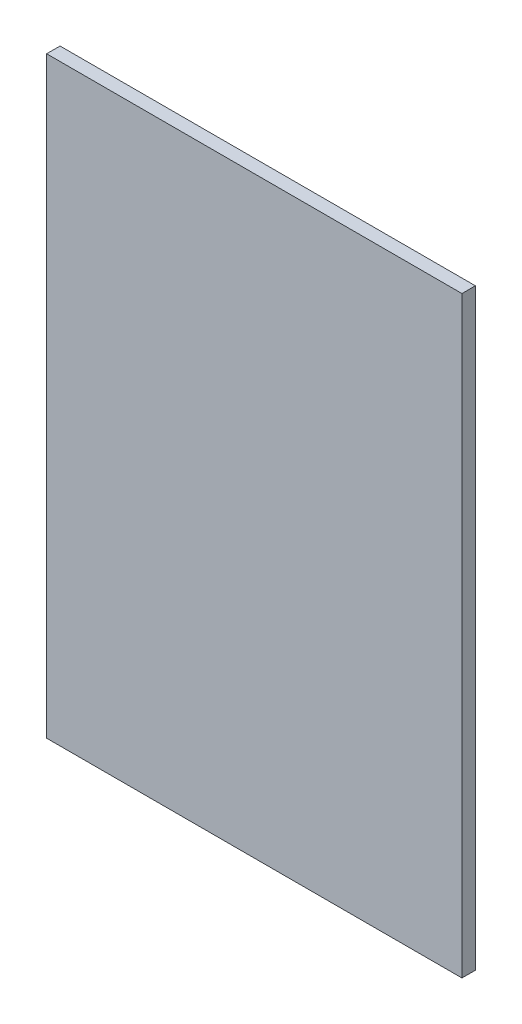
ISO-10303-21;
HEADER;
FILE_DESCRIPTION(('STEP AP214'),'2;1');
FILE_NAME('part.step','',(''),(''),'','','');
FILE_SCHEMA(('AUTOMOTIVE_DESIGN { 1 0 10303 214 1 1 1 1 }'));
ENDSEC;
DATA;
#1=APPLICATION_CONTEXT('core data for automotive mechanical design processes');
#2=APPLICATION_PROTOCOL_DEFINITION('international standard','automotive_design',2000,#1);
#3=PRODUCT_CONTEXT('',#1,'mechanical');
#4=PRODUCT('Part','Part','',(#3));
#5=PRODUCT_RELATED_PRODUCT_CATEGORY('part','',(#4));
#6=PRODUCT_DEFINITION_FORMATION('','',#4);
#7=PRODUCT_DEFINITION_CONTEXT('part definition',#1,'design');
#8=PRODUCT_DEFINITION('design','',#6,#7);
#9=PRODUCT_DEFINITION_SHAPE('','',#8);
#10=(LENGTH_UNIT() NAMED_UNIT(*) SI_UNIT(.MILLI.,.METRE.));
#11=(NAMED_UNIT(*) PLANE_ANGLE_UNIT() SI_UNIT($,.RADIAN.));
#12=(NAMED_UNIT(*) SI_UNIT($,.STERADIAN.) SOLID_ANGLE_UNIT());
#13=UNCERTAINTY_MEASURE_WITH_UNIT(LENGTH_MEASURE(1.E-05),#10,'distance_accuracy_value','');
#14=(GEOMETRIC_REPRESENTATION_CONTEXT(3) GLOBAL_UNCERTAINTY_ASSIGNED_CONTEXT((#13)) GLOBAL_UNIT_ASSIGNED_CONTEXT((#10,
#11,#12)) REPRESENTATION_CONTEXT('',''));
#15=CARTESIAN_POINT('',(0.,0.,0.));
#16=DIRECTION('',(0.,0.,1.));
#17=DIRECTION('',(1.,0.,0.));
#18=AXIS2_PLACEMENT_3D('',#15,#16,#17);
#19=CARTESIAN_POINT('',(94.9570007324219,90.9720001220703,0.));
#20=DIRECTION('',(1.,0.,0.));
#21=DIRECTION('',(0.,-1.,0.));
#22=AXIS2_PLACEMENT_3D('',#19,#20,#21);
#23=PLANE('',#22);
#24=DIRECTION('',(0.,-1.,0.));
#25=VECTOR('',#24,1.);
#26=CARTESIAN_POINT('',(94.9570007324219,90.9720001220703,0.03556));
#27=LINE('',#26,#25);
#28=CARTESIAN_POINT('',(94.9570007324219,90.9720001220703,0.03556));
#29=VERTEX_POINT('',#28);
#30=CARTESIAN_POINT('',(94.9570007324219,89.4020004272461,0.03556));
#31=VERTEX_POINT('',#30);
#32=EDGE_CURVE('E11',#29,#31,#27,.T.);
#33=ORIENTED_EDGE('',*,*,#32,.F.);
#34=DIRECTION('',(0.,0.,1.));
#35=VECTOR('',#34,1.);
#36=CARTESIAN_POINT('',(94.9570007324219,90.9720001220703,0.));
#37=LINE('',#36,#35);
#38=CARTESIAN_POINT('',(94.9570007324219,90.9720001220703,0.));
#39=VERTEX_POINT('',#38);
#40=EDGE_CURVE('E24',#39,#29,#37,.T.);
#41=ORIENTED_EDGE('',*,*,#40,.F.);
#42=DIRECTION('',(0.,-1.,0.));
#43=VECTOR('',#42,1.);
#44=CARTESIAN_POINT('',(94.9570007324219,90.9720001220703,0.));
#45=LINE('',#44,#43);
#46=CARTESIAN_POINT('',(94.9570007324219,89.4020004272461,0.));
#47=VERTEX_POINT('',#46);
#48=EDGE_CURVE('E75',#39,#47,#45,.T.);
#49=ORIENTED_EDGE('',*,*,#48,.T.);
#50=DIRECTION('',(0.,0.,1.));
#51=VECTOR('',#50,1.);
#52=CARTESIAN_POINT('',(94.9570007324219,89.4020004272461,0.));
#53=LINE('',#52,#51);
#54=EDGE_CURVE('E37',#47,#31,#53,.T.);
#55=ORIENTED_EDGE('',*,*,#54,.T.);
#56=EDGE_LOOP('',(#33,#41,#49,#55));
#57=FACE_BOUND('',#56,.T.);
#58=ADVANCED_FACE('F17',(#57),#23,.F.);
#59=CARTESIAN_POINT('',(94.9570007324219,89.4020004272461,0.));
#60=DIRECTION('',(0.,1.,0.));
#61=DIRECTION('',(1.,0.,0.));
#62=AXIS2_PLACEMENT_3D('',#59,#60,#61);
#63=PLANE('',#62);
#64=DIRECTION('',(1.,0.,0.));
#65=VECTOR('',#64,1.);
#66=CARTESIAN_POINT('',(94.9570007324219,89.4020004272461,0.03556));
#67=LINE('',#66,#65);
#68=CARTESIAN_POINT('',(96.056999206543,89.4020004272461,0.03556));
#69=VERTEX_POINT('',#68);
#70=EDGE_CURVE('E83',#31,#69,#67,.T.);
#71=ORIENTED_EDGE('',*,*,#70,.F.);
#72=ORIENTED_EDGE('',*,*,#54,.F.);
#73=DIRECTION('',(1.,0.,0.));
#74=VECTOR('',#73,1.);
#75=CARTESIAN_POINT('',(94.9570007324219,89.4020004272461,0.));
#76=LINE('',#75,#74);
#77=CARTESIAN_POINT('',(96.056999206543,89.4020004272461,0.));
#78=VERTEX_POINT('',#77);
#79=EDGE_CURVE('E81',#47,#78,#76,.T.);
#80=ORIENTED_EDGE('',*,*,#79,.T.);
#81=DIRECTION('',(0.,0.,1.));
#82=VECTOR('',#81,1.);
#83=CARTESIAN_POINT('',(96.056999206543,89.4020004272461,0.));
#84=LINE('',#83,#82);
#85=EDGE_CURVE('E67',#78,#69,#84,.T.);
#86=ORIENTED_EDGE('',*,*,#85,.T.);
#87=EDGE_LOOP('',(#71,#72,#80,#86));
#88=FACE_BOUND('',#87,.T.);
#89=ADVANCED_FACE('F89',(#88),#63,.F.);
#90=CARTESIAN_POINT('',(96.056999206543,89.4020004272461,0.));
#91=DIRECTION('',(-1.,0.,0.));
#92=DIRECTION('',(0.,1.,0.));
#93=AXIS2_PLACEMENT_3D('',#90,#91,#92);
#94=PLANE('',#93);
#95=DIRECTION('',(0.,1.,0.));
#96=VECTOR('',#95,1.);
#97=CARTESIAN_POINT('',(96.056999206543,89.4020004272461,0.03556));
#98=LINE('',#97,#96);
#99=CARTESIAN_POINT('',(96.056999206543,90.9720001220703,0.03556));
#100=VERTEX_POINT('',#99);
#101=EDGE_CURVE('E71',#69,#100,#98,.T.);
#102=ORIENTED_EDGE('',*,*,#101,.F.);
#103=ORIENTED_EDGE('',*,*,#85,.F.);
#104=DIRECTION('',(0.,1.,0.));
#105=VECTOR('',#104,1.);
#106=CARTESIAN_POINT('',(96.056999206543,89.4020004272461,0.));
#107=LINE('',#106,#105);
#108=CARTESIAN_POINT('',(96.056999206543,90.9720001220703,0.));
#109=VERTEX_POINT('',#108);
#110=EDGE_CURVE('E63',#78,#109,#107,.T.);
#111=ORIENTED_EDGE('',*,*,#110,.T.);
#112=DIRECTION('',(0.,0.,1.));
#113=VECTOR('',#112,1.);
#114=CARTESIAN_POINT('',(96.056999206543,90.9720001220703,0.));
#115=LINE('',#114,#113);
#116=EDGE_CURVE('E53',#109,#100,#115,.T.);
#117=ORIENTED_EDGE('',*,*,#116,.T.);
#118=EDGE_LOOP('',(#102,#103,#111,#117));
#119=FACE_BOUND('',#118,.T.);
#120=ADVANCED_FACE('F66',(#119),#94,.F.);
#121=CARTESIAN_POINT('',(96.056999206543,90.9720001220703,0.));
#122=DIRECTION('',(0.,-1.,0.));
#123=DIRECTION('',(-1.,0.,0.));
#124=AXIS2_PLACEMENT_3D('',#121,#122,#123);
#125=PLANE('',#124);
#126=DIRECTION('',(-1.,0.,0.));
#127=VECTOR('',#126,1.);
#128=CARTESIAN_POINT('',(96.056999206543,90.9720001220703,0.03556));
#129=LINE('',#128,#127);
#130=EDGE_CURVE('E59',#100,#29,#129,.T.);
#131=ORIENTED_EDGE('',*,*,#130,.F.);
#132=ORIENTED_EDGE('',*,*,#116,.F.);
#133=DIRECTION('',(-1.,0.,0.));
#134=VECTOR('',#133,1.);
#135=CARTESIAN_POINT('',(96.056999206543,90.9720001220703,0.));
#136=LINE('',#135,#134);
#137=EDGE_CURVE('E57',#109,#39,#136,.T.);
#138=ORIENTED_EDGE('',*,*,#137,.T.);
#139=ORIENTED_EDGE('',*,*,#40,.T.);
#140=EDGE_LOOP('',(#131,#132,#138,#139));
#141=FACE_BOUND('',#140,.T.);
#142=ADVANCED_FACE('F55',(#141),#125,.F.);
#143=CARTESIAN_POINT('',(94.9570007324219,90.9720001220703,0.));
#144=DIRECTION('',(0.,0.,-1.));
#145=DIRECTION('',(-1.,0.,0.));
#146=AXIS2_PLACEMENT_3D('',#143,#144,#145);
#147=PLANE('',#146);
#148=ORIENTED_EDGE('',*,*,#137,.F.);
#149=ORIENTED_EDGE('',*,*,#110,.F.);
#150=ORIENTED_EDGE('',*,*,#79,.F.);
#151=ORIENTED_EDGE('',*,*,#48,.F.);
#152=EDGE_LOOP('',(#148,#149,#150,#151));
#153=FACE_BOUND('',#152,.T.);
#154=ADVANCED_FACE('F74',(#153),#147,.T.);
#155=CARTESIAN_POINT('',(94.9570007324219,90.9720001220703,0.03556));
#156=DIRECTION('',(0.,0.,-1.));
#157=DIRECTION('',(-1.,0.,0.));
#158=AXIS2_PLACEMENT_3D('',#155,#156,#157);
#159=PLANE('',#158);
#160=ORIENTED_EDGE('',*,*,#32,.T.);
#161=ORIENTED_EDGE('',*,*,#70,.T.);
#162=ORIENTED_EDGE('',*,*,#101,.T.);
#163=ORIENTED_EDGE('',*,*,#130,.T.);
#164=EDGE_LOOP('',(#160,#161,#162,#163));
#165=FACE_BOUND('',#164,.T.);
#166=ADVANCED_FACE('F91',(#165),#159,.F.);
#167=CLOSED_SHELL('',(#58,#89,#120,#142,#154,#166));
#168=MANIFOLD_SOLID_BREP('B1',#167);
#169=ADVANCED_BREP_SHAPE_REPRESENTATION('',(#18,#168),#14);
#170=SHAPE_DEFINITION_REPRESENTATION(#9,#169);
ENDSEC;
END-ISO-10303-21;
